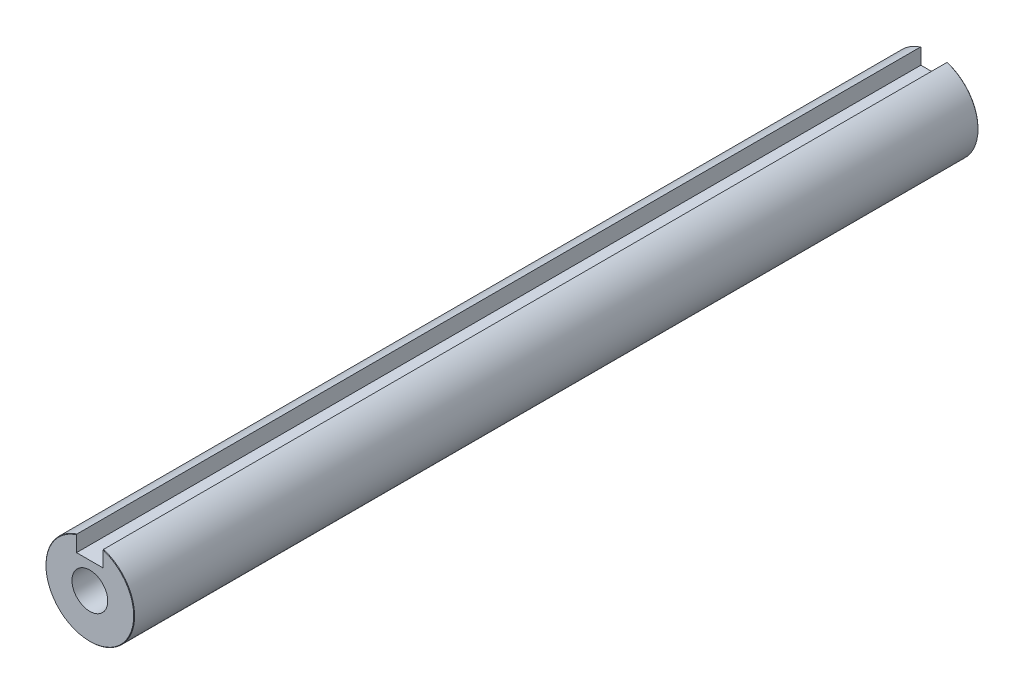
ISO-10303-21;
HEADER;
FILE_DESCRIPTION(('STEP AP214'),'2;1');
FILE_NAME('part.step','',(''),(''),'','','');
FILE_SCHEMA(('AUTOMOTIVE_DESIGN { 1 0 10303 214 1 1 1 1 }'));
ENDSEC;
DATA;
#1=APPLICATION_CONTEXT('core data for automotive mechanical design processes');
#2=APPLICATION_PROTOCOL_DEFINITION('international standard','automotive_design',2000,#1);
#3=PRODUCT_CONTEXT('',#1,'mechanical');
#4=PRODUCT('Part','Part','',(#3));
#5=PRODUCT_RELATED_PRODUCT_CATEGORY('part','',(#4));
#6=PRODUCT_DEFINITION_FORMATION('','',#4);
#7=PRODUCT_DEFINITION_CONTEXT('part definition',#1,'design');
#8=PRODUCT_DEFINITION('design','',#6,#7);
#9=PRODUCT_DEFINITION_SHAPE('','',#8);
#10=(LENGTH_UNIT() NAMED_UNIT(*) SI_UNIT(.MILLI.,.METRE.));
#11=(NAMED_UNIT(*) PLANE_ANGLE_UNIT() SI_UNIT($,.RADIAN.));
#12=(NAMED_UNIT(*) SI_UNIT($,.STERADIAN.) SOLID_ANGLE_UNIT());
#13=UNCERTAINTY_MEASURE_WITH_UNIT(LENGTH_MEASURE(1.E-05),#10,'distance_accuracy_value','');
#14=(GEOMETRIC_REPRESENTATION_CONTEXT(3) GLOBAL_UNCERTAINTY_ASSIGNED_CONTEXT((#13)) GLOBAL_UNIT_ASSIGNED_CONTEXT((#10,
#11,#12)) REPRESENTATION_CONTEXT('',''));
#15=CARTESIAN_POINT('',(0.,0.,0.));
#16=DIRECTION('',(0.,0.,1.));
#17=DIRECTION('',(1.,0.,0.));
#18=AXIS2_PLACEMENT_3D('',#15,#16,#17);
#19=CARTESIAN_POINT('',(0.,0.,47.625));
#20=DIRECTION('',(0.,0.,-1.));
#21=DIRECTION('',(-1.,0.,0.));
#22=AXIS2_PLACEMENT_3D('',#19,#20,#21);
#23=CYLINDRICAL_SURFACE('',#22,5.00000000000007);
#24=DIRECTION('',(0.,0.,-1.));
#25=VECTOR('',#24,1.);
#26=CARTESIAN_POINT('',(1.5,4.7696960070848,47.625));
#27=LINE('',#26,#25);
#28=CARTESIAN_POINT('',(1.5,4.7696960070848,47.575));
#29=VERTEX_POINT('',#28);
#30=CARTESIAN_POINT('',(1.5,4.7696960070848,-47.575));
#31=VERTEX_POINT('',#30);
#32=EDGE_CURVE('E138',#29,#31,#27,.T.);
#33=ORIENTED_EDGE('',*,*,#32,.F.);
#34=CARTESIAN_POINT('',(0.,0.,47.575));
#35=DIRECTION('',(0.,0.,1.));
#36=DIRECTION('',(1.,0.,0.));
#37=AXIS2_PLACEMENT_3D('',#34,#35,#36);
#38=CIRCLE('',#37,5.00000000000007);
#39=CARTESIAN_POINT('',(-1.5,4.7696960070848,47.575));
#40=VERTEX_POINT('',#39);
#41=EDGE_CURVE('E216',#29,#40,#38,.F.);
#42=ORIENTED_EDGE('',*,*,#41,.T.);
#43=DIRECTION('',(0.,0.,-1.));
#44=VECTOR('',#43,1.);
#45=CARTESIAN_POINT('',(-1.5,4.7696960070848,47.625));
#46=LINE('',#45,#44);
#47=CARTESIAN_POINT('',(-1.5,4.7696960070848,-47.575));
#48=VERTEX_POINT('',#47);
#49=EDGE_CURVE('E131',#40,#48,#46,.T.);
#50=ORIENTED_EDGE('',*,*,#49,.T.);
#51=CARTESIAN_POINT('',(0.,0.,-47.575));
#52=DIRECTION('',(0.,0.,1.));
#53=DIRECTION('',(1.,0.,0.));
#54=AXIS2_PLACEMENT_3D('',#51,#52,#53);
#55=CIRCLE('',#54,5.00000000000007);
#56=EDGE_CURVE('E218',#48,#31,#55,.T.);
#57=ORIENTED_EDGE('',*,*,#56,.T.);
#58=EDGE_LOOP('',(#33,#42,#50,#57));
#59=FACE_BOUND('',#58,.T.);
#60=ADVANCED_FACE('F37',(#59),#23,.T.);
#61=CARTESIAN_POINT('',(1.5,2.9696960070848,47.625));
#62=DIRECTION('',(1.,0.,0.));
#63=DIRECTION('',(0.,0.,-1.));
#64=AXIS2_PLACEMENT_3D('',#61,#62,#63);
#65=PLANE('',#64);
#66=DIRECTION('',(0.,-1.,0.));
#67=VECTOR('',#66,1.);
#68=CARTESIAN_POINT('',(1.5,2.9696960070848,47.625));
#69=LINE('',#68,#67);
#70=CARTESIAN_POINT('',(1.5,4.71725555805499,47.625));
#71=VERTEX_POINT('',#70);
#72=CARTESIAN_POINT('',(1.5,2.9696960070848,47.625));
#73=VERTEX_POINT('',#72);
#74=EDGE_CURVE('E124',#71,#73,#69,.T.);
#75=ORIENTED_EDGE('',*,*,#74,.F.);
#76=CARTESIAN_POINT('',(1.5,4.71725555805499,47.625));
#77=CARTESIAN_POINT('',(1.5,4.72599772432691,47.6166688601797));
#78=CARTESIAN_POINT('',(1.5,4.73473884488237,47.6083366236025));
#79=CARTESIAN_POINT('',(1.5,4.75221899455897,47.5916699569358));
#80=CARTESIAN_POINT('',(1.5,4.76095802368012,47.5833355268463));
#81=CARTESIAN_POINT('',(1.5,4.7696960070848,47.575));
#82=B_SPLINE_CURVE_WITH_KNOTS('',3,(#76,#77,#78,#79,#80,#81),.UNSPECIFIED.,.F.,.F.,(4,2,4),(0.,
0.0362284445496542,0.072456889093579),.UNSPECIFIED.);
#83=EDGE_CURVE('E151',#71,#29,#82,.T.);
#84=ORIENTED_EDGE('',*,*,#83,.T.);
#85=ORIENTED_EDGE('',*,*,#32,.T.);
#86=CARTESIAN_POINT('',(1.5,4.7696960070848,-47.575));
#87=CARTESIAN_POINT('',(1.5,4.76095802368012,-47.5833355268463));
#88=CARTESIAN_POINT('',(1.5,4.75221899455898,-47.5916699569358));
#89=CARTESIAN_POINT('',(1.5,4.73473884488238,-47.6083366236025));
#90=CARTESIAN_POINT('',(1.5,4.72599772432692,-47.6166688601797));
#91=CARTESIAN_POINT('',(1.5,4.717255558055,-47.625));
#92=B_SPLINE_CURVE_WITH_KNOTS('',3,(#86,#87,#88,#89,#90,#91),.UNSPECIFIED.,.F.,.F.,(4,2,4),(0.,
0.0362284445439131,0.0724568890935629),.UNSPECIFIED.);
#93=CARTESIAN_POINT('',(1.5,4.717255558055,-47.625));
#94=VERTEX_POINT('',#93);
#95=EDGE_CURVE('E144',#31,#94,#92,.T.);
#96=ORIENTED_EDGE('',*,*,#95,.T.);
#97=DIRECTION('',(0.,-1.,0.));
#98=VECTOR('',#97,1.);
#99=CARTESIAN_POINT('',(1.5,2.9696960070848,-47.625));
#100=LINE('',#99,#98);
#101=CARTESIAN_POINT('',(1.5,2.9696960070848,-47.625));
#102=VERTEX_POINT('',#101);
#103=EDGE_CURVE('E117',#94,#102,#100,.T.);
#104=ORIENTED_EDGE('',*,*,#103,.T.);
#105=DIRECTION('',(0.,0.,-1.));
#106=VECTOR('',#105,1.);
#107=CARTESIAN_POINT('',(1.5,2.9696960070848,47.625));
#108=LINE('',#107,#106);
#109=EDGE_CURVE('E135',#73,#102,#108,.T.);
#110=ORIENTED_EDGE('',*,*,#109,.F.);
#111=EDGE_LOOP('',(#75,#84,#85,#96,#104,#110));
#112=FACE_BOUND('',#111,.T.);
#113=ADVANCED_FACE('F157',(#112),#65,.F.);
#114=CARTESIAN_POINT('',(1.5,2.9696960070848,47.625));
#115=DIRECTION('',(0.,-1.,0.));
#116=DIRECTION('',(0.,0.,-1.));
#117=AXIS2_PLACEMENT_3D('',#114,#115,#116);
#118=PLANE('',#117);
#119=ORIENTED_EDGE('',*,*,#109,.T.);
#120=DIRECTION('',(-1.,0.,0.));
#121=VECTOR('',#120,1.);
#122=CARTESIAN_POINT('',(1.5,2.9696960070848,-47.625));
#123=LINE('',#122,#121);
#124=CARTESIAN_POINT('',(-1.5,2.9696960070848,-47.625));
#125=VERTEX_POINT('',#124);
#126=EDGE_CURVE('E119',#102,#125,#123,.T.);
#127=ORIENTED_EDGE('',*,*,#126,.T.);
#128=DIRECTION('',(0.,0.,-1.));
#129=VECTOR('',#128,1.);
#130=CARTESIAN_POINT('',(-1.5,2.9696960070848,47.625));
#131=LINE('',#130,#129);
#132=CARTESIAN_POINT('',(-1.5,2.9696960070848,47.625));
#133=VERTEX_POINT('',#132);
#134=EDGE_CURVE('E133',#133,#125,#131,.T.);
#135=ORIENTED_EDGE('',*,*,#134,.F.);
#136=DIRECTION('',(-1.,0.,0.));
#137=VECTOR('',#136,1.);
#138=CARTESIAN_POINT('',(1.5,2.9696960070848,47.625));
#139=LINE('',#138,#137);
#140=EDGE_CURVE('E126',#73,#133,#139,.T.);
#141=ORIENTED_EDGE('',*,*,#140,.F.);
#142=EDGE_LOOP('',(#119,#127,#135,#141));
#143=FACE_BOUND('',#142,.T.);
#144=ADVANCED_FACE('F162',(#143),#118,.F.);
#145=CARTESIAN_POINT('',(-1.5,2.9696960070848,47.625));
#146=DIRECTION('',(-1.,0.,0.));
#147=DIRECTION('',(0.,0.,1.));
#148=AXIS2_PLACEMENT_3D('',#145,#146,#147);
#149=PLANE('',#148);
#150=ORIENTED_EDGE('',*,*,#49,.F.);
#151=CARTESIAN_POINT('',(-1.5,4.7696960070848,47.575));
#152=CARTESIAN_POINT('',(-1.5,4.76095802368012,47.5833355268463));
#153=CARTESIAN_POINT('',(-1.5,4.75221899455897,47.5916699569358));
#154=CARTESIAN_POINT('',(-1.5,4.73473884488237,47.6083366236025));
#155=CARTESIAN_POINT('',(-1.5,4.72599772432691,47.6166688601797));
#156=CARTESIAN_POINT('',(-1.5,4.71725555805499,47.625));
#157=B_SPLINE_CURVE_WITH_KNOTS('',3,(#151,#152,#153,#154,#155,#156),.UNSPECIFIED.,.F.,.F.,(4,2,
4),(0.,0.0362284445439248,0.0724568890935784),.UNSPECIFIED.);
#158=CARTESIAN_POINT('',(-1.5,4.71725555805499,47.625));
#159=VERTEX_POINT('',#158);
#160=EDGE_CURVE('E46',#40,#159,#157,.T.);
#161=ORIENTED_EDGE('',*,*,#160,.T.);
#162=DIRECTION('',(0.,1.,0.));
#163=VECTOR('',#162,1.);
#164=CARTESIAN_POINT('',(-1.5,2.9696960070848,47.625));
#165=LINE('',#164,#163);
#166=EDGE_CURVE('E128',#133,#159,#165,.T.);
#167=ORIENTED_EDGE('',*,*,#166,.F.);
#168=ORIENTED_EDGE('',*,*,#134,.T.);
#169=DIRECTION('',(0.,1.,0.));
#170=VECTOR('',#169,1.);
#171=CARTESIAN_POINT('',(-1.5,2.9696960070848,-47.625));
#172=LINE('',#171,#170);
#173=CARTESIAN_POINT('',(-1.5,4.717255558055,-47.625));
#174=VERTEX_POINT('',#173);
#175=EDGE_CURVE('E122',#125,#174,#172,.T.);
#176=ORIENTED_EDGE('',*,*,#175,.T.);
#177=CARTESIAN_POINT('',(-1.5,4.717255558055,-47.625));
#178=CARTESIAN_POINT('',(-1.5,4.72599772432692,-47.6166688601797));
#179=CARTESIAN_POINT('',(-1.5,4.73473884488238,-47.6083366236025));
#180=CARTESIAN_POINT('',(-1.5,4.75221899455898,-47.5916699569358));
#181=CARTESIAN_POINT('',(-1.5,4.76095802368012,-47.5833355268463));
#182=CARTESIAN_POINT('',(-1.5,4.7696960070848,-47.575));
#183=B_SPLINE_CURVE_WITH_KNOTS('',3,(#177,#178,#179,#180,#181,#182),.UNSPECIFIED.,.F.,.F.,(4,2,
4),(0.,0.0362284445496505,0.0724568890935635),.UNSPECIFIED.);
#184=EDGE_CURVE('E58',#174,#48,#183,.T.);
#185=ORIENTED_EDGE('',*,*,#184,.T.);
#186=EDGE_LOOP('',(#150,#161,#167,#168,#176,#185));
#187=FACE_BOUND('',#186,.T.);
#188=ADVANCED_FACE('F184',(#187),#149,.F.);
#189=CARTESIAN_POINT('',(0.,0.,47.625));
#190=DIRECTION('',(0.,0.,1.));
#191=DIRECTION('',(1.,0.,0.));
#192=AXIS2_PLACEMENT_3D('',#189,#190,#191);
#193=PLANE('',#192);
#194=CARTESIAN_POINT('',(0.,0.,47.625));
#195=DIRECTION('',(0.,0.,1.));
#196=DIRECTION('',(1.,0.,0.));
#197=AXIS2_PLACEMENT_3D('',#194,#195,#196);
#198=CIRCLE('',#197,2.0193);
#199=CARTESIAN_POINT('',(2.0193,0.,47.625));
#200=VERTEX_POINT('',#199);
#201=EDGE_CURVE('E107',#200,#200,#198,.T.);
#202=ORIENTED_EDGE('',*,*,#201,.F.);
#203=EDGE_LOOP('',(#202));
#204=FACE_BOUND('',#203,.T.);
#205=ORIENTED_EDGE('',*,*,#166,.T.);
#206=CARTESIAN_POINT('',(0.,0.,47.625));
#207=DIRECTION('',(0.,0.,1.));
#208=DIRECTION('',(1.,0.,0.));
#209=AXIS2_PLACEMENT_3D('',#206,#207,#208);
#210=CIRCLE('',#209,4.95000000000007);
#211=EDGE_CURVE('E141',#159,#71,#210,.T.);
#212=ORIENTED_EDGE('',*,*,#211,.T.);
#213=ORIENTED_EDGE('',*,*,#74,.T.);
#214=ORIENTED_EDGE('',*,*,#140,.T.);
#215=EDGE_LOOP('',(#205,#212,#213,#214));
#216=FACE_BOUND('',#215,.T.);
#217=ADVANCED_FACE('F188',(#204,#216),#193,.T.);
#218=CARTESIAN_POINT('',(0.,0.,-47.625));
#219=DIRECTION('',(0.,0.,1.));
#220=DIRECTION('',(1.,0.,0.));
#221=AXIS2_PLACEMENT_3D('',#218,#219,#220);
#222=PLANE('',#221);
#223=CARTESIAN_POINT('',(0.,0.,-47.625));
#224=DIRECTION('',(0.,0.,-1.));
#225=DIRECTION('',(-1.,0.,0.));
#226=AXIS2_PLACEMENT_3D('',#223,#224,#225);
#227=CIRCLE('',#226,2.0193);
#228=CARTESIAN_POINT('',(-2.0193,0.,-47.625));
#229=VERTEX_POINT('',#228);
#230=EDGE_CURVE('E106',#229,#229,#227,.T.);
#231=ORIENTED_EDGE('',*,*,#230,.F.);
#232=EDGE_LOOP('',(#231));
#233=FACE_BOUND('',#232,.T.);
#234=ORIENTED_EDGE('',*,*,#103,.F.);
#235=CARTESIAN_POINT('',(0.,0.,-47.625));
#236=DIRECTION('',(0.,0.,1.));
#237=DIRECTION('',(1.,0.,0.));
#238=AXIS2_PLACEMENT_3D('',#235,#236,#237);
#239=CIRCLE('',#238,4.95000000000008);
#240=EDGE_CURVE('E11',#94,#174,#239,.F.);
#241=ORIENTED_EDGE('',*,*,#240,.T.);
#242=ORIENTED_EDGE('',*,*,#175,.F.);
#243=ORIENTED_EDGE('',*,*,#126,.F.);
#244=EDGE_LOOP('',(#234,#241,#242,#243));
#245=FACE_BOUND('',#244,.T.);
#246=ADVANCED_FACE('F171',(#233,#245),#222,.F.);
#247=CARTESIAN_POINT('',(0.,0.,47.625));
#248=DIRECTION('',(0.,0.,-1.));
#249=DIRECTION('',(-1.,0.,0.));
#250=AXIS2_PLACEMENT_3D('',#247,#248,#249);
#251=CONICAL_SURFACE('',#250,4.95000000000007,0.785398163397474);
#252=ORIENTED_EDGE('',*,*,#160,.F.);
#253=ORIENTED_EDGE('',*,*,#41,.F.);
#254=ORIENTED_EDGE('',*,*,#83,.F.);
#255=ORIENTED_EDGE('',*,*,#211,.F.);
#256=EDGE_LOOP('',(#252,#253,#254,#255));
#257=FACE_BOUND('',#256,.T.);
#258=ADVANCED_FACE('F168',(#257),#251,.T.);
#259=CARTESIAN_POINT('',(0.,0.,-47.575));
#260=DIRECTION('',(0.,0.,1.));
#261=DIRECTION('',(1.,0.,0.));
#262=AXIS2_PLACEMENT_3D('',#259,#260,#261);
#263=CONICAL_SURFACE('',#262,5.00000000000007,0.785398163397405);
#264=ORIENTED_EDGE('',*,*,#184,.F.);
#265=ORIENTED_EDGE('',*,*,#240,.F.);
#266=ORIENTED_EDGE('',*,*,#95,.F.);
#267=ORIENTED_EDGE('',*,*,#56,.F.);
#268=EDGE_LOOP('',(#264,#265,#266,#267));
#269=FACE_BOUND('',#268,.T.);
#270=ADVANCED_FACE('F39',(#269),#263,.T.);
#271=CARTESIAN_POINT('',(0.,0.,-31.75));
#272=DIRECTION('',(0.,0.,-1.));
#273=DIRECTION('',(-1.,0.,0.));
#274=AXIS2_PLACEMENT_3D('',#271,#272,#273);
#275=CONICAL_SURFACE('',#274,2.0193,1.02974425867665);
#276=CARTESIAN_POINT('',(0.,0.,-30.5366821519976));
#277=VERTEX_POINT('',#276);
#278=VERTEX_LOOP('',#277);
#279=FACE_BOUND('',#278,.T.);
#280=CARTESIAN_POINT('',(0.,0.,-31.75));
#281=DIRECTION('',(0.,0.,-1.));
#282=DIRECTION('',(-1.,0.,0.));
#283=AXIS2_PLACEMENT_3D('',#280,#281,#282);
#284=CIRCLE('',#283,2.0193);
#285=CARTESIAN_POINT('',(-2.0193,0.,-31.75));
#286=VERTEX_POINT('',#285);
#287=EDGE_CURVE('E110',#286,#286,#284,.T.);
#288=ORIENTED_EDGE('',*,*,#287,.T.);
#289=EDGE_LOOP('',(#288));
#290=FACE_BOUND('',#289,.T.);
#291=ADVANCED_FACE('F196',(#279,#290),#275,.F.);
#292=CARTESIAN_POINT('',(0.,0.,-47.625));
#293=DIRECTION('',(0.,0.,-1.));
#294=DIRECTION('',(-1.,0.,0.));
#295=AXIS2_PLACEMENT_3D('',#292,#293,#294);
#296=CYLINDRICAL_SURFACE('',#295,2.0193);
#297=ORIENTED_EDGE('',*,*,#287,.F.);
#298=EDGE_LOOP('',(#297));
#299=FACE_BOUND('',#298,.T.);
#300=ORIENTED_EDGE('',*,*,#230,.T.);
#301=EDGE_LOOP('',(#300));
#302=FACE_BOUND('',#301,.T.);
#303=ADVANCED_FACE('F100',(#299,#302),#296,.F.);
#304=CARTESIAN_POINT('',(0.,0.,38.1));
#305=DIRECTION('',(0.,0.,1.));
#306=DIRECTION('',(1.,0.,0.));
#307=AXIS2_PLACEMENT_3D('',#304,#305,#306);
#308=CONICAL_SURFACE('',#307,2.0193,1.02974425867665);
#309=CARTESIAN_POINT('',(0.,0.,36.8866821519976));
#310=VERTEX_POINT('',#309);
#311=VERTEX_LOOP('',#310);
#312=FACE_BOUND('',#311,.T.);
#313=CARTESIAN_POINT('',(0.,0.,38.1));
#314=DIRECTION('',(0.,0.,1.));
#315=DIRECTION('',(1.,0.,0.));
#316=AXIS2_PLACEMENT_3D('',#313,#314,#315);
#317=CIRCLE('',#316,2.0193);
#318=CARTESIAN_POINT('',(2.0193,0.,38.1));
#319=VERTEX_POINT('',#318);
#320=EDGE_CURVE('E104',#319,#319,#317,.T.);
#321=ORIENTED_EDGE('',*,*,#320,.T.);
#322=EDGE_LOOP('',(#321));
#323=FACE_BOUND('',#322,.T.);
#324=ADVANCED_FACE('F96',(#312,#323),#308,.F.);
#325=CARTESIAN_POINT('',(0.,0.,47.625));
#326=DIRECTION('',(0.,0.,1.));
#327=DIRECTION('',(1.,0.,0.));
#328=AXIS2_PLACEMENT_3D('',#325,#326,#327);
#329=CYLINDRICAL_SURFACE('',#328,2.0193);
#330=ORIENTED_EDGE('',*,*,#320,.F.);
#331=EDGE_LOOP('',(#330));
#332=FACE_BOUND('',#331,.T.);
#333=ORIENTED_EDGE('',*,*,#201,.T.);
#334=EDGE_LOOP('',(#333));
#335=FACE_BOUND('',#334,.T.);
#336=ADVANCED_FACE('F99',(#332,#335),#329,.F.);
#337=CLOSED_SHELL('',(#60,#113,#144,#188,#217,#246,#258,#270,#291,#303,#324,#336));
#338=MANIFOLD_SOLID_BREP('B2',#337);
#339=ADVANCED_BREP_SHAPE_REPRESENTATION('',(#18,#338),#14);
#340=SHAPE_DEFINITION_REPRESENTATION(#9,#339);
ENDSEC;
END-ISO-10303-21;
